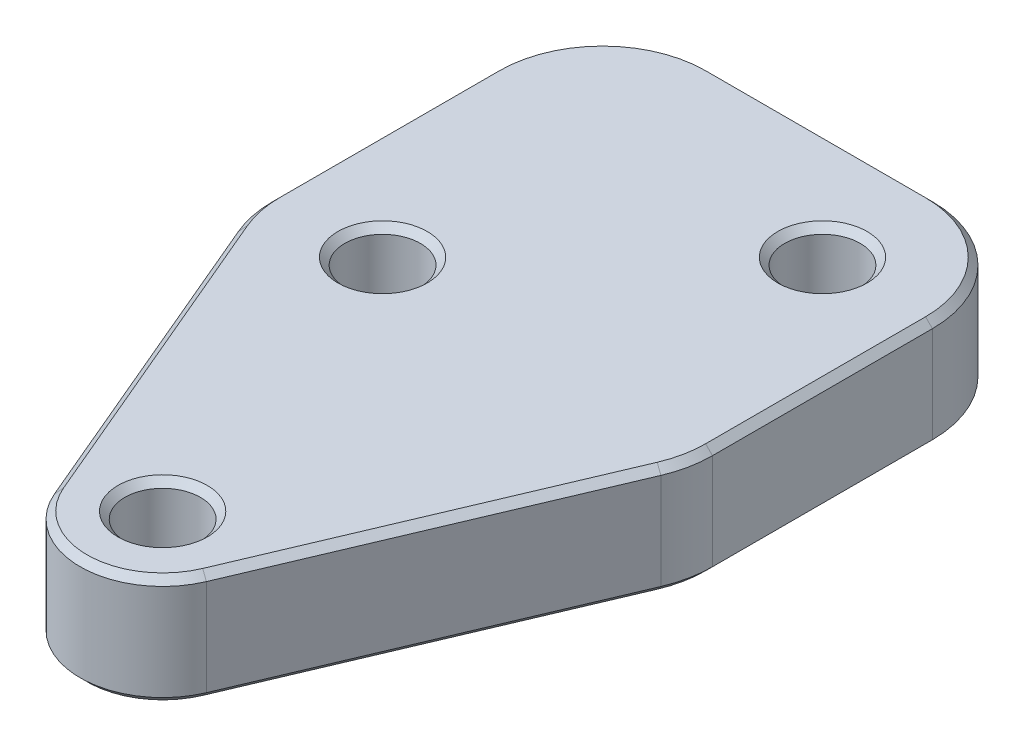
ISO-10303-21;
HEADER;
FILE_DESCRIPTION(('STEP AP214'),'2;1');
FILE_NAME('part.step','',(''),(''),'','','');
FILE_SCHEMA(('AUTOMOTIVE_DESIGN { 1 0 10303 214 1 1 1 1 }'));
ENDSEC;
DATA;
#1=APPLICATION_CONTEXT('core data for automotive mechanical design processes');
#2=APPLICATION_PROTOCOL_DEFINITION('international standard','automotive_design',2000,#1);
#3=PRODUCT_CONTEXT('',#1,'mechanical');
#4=PRODUCT('Part','Part','',(#3));
#5=PRODUCT_RELATED_PRODUCT_CATEGORY('part','',(#4));
#6=PRODUCT_DEFINITION_FORMATION('','',#4);
#7=PRODUCT_DEFINITION_CONTEXT('part definition',#1,'design');
#8=PRODUCT_DEFINITION('design','',#6,#7);
#9=PRODUCT_DEFINITION_SHAPE('','',#8);
#10=(LENGTH_UNIT() NAMED_UNIT(*) SI_UNIT(.MILLI.,.METRE.));
#11=(NAMED_UNIT(*) PLANE_ANGLE_UNIT() SI_UNIT($,.RADIAN.));
#12=(NAMED_UNIT(*) SI_UNIT($,.STERADIAN.) SOLID_ANGLE_UNIT());
#13=UNCERTAINTY_MEASURE_WITH_UNIT(LENGTH_MEASURE(1.E-05),#10,'distance_accuracy_value','');
#14=(GEOMETRIC_REPRESENTATION_CONTEXT(3) GLOBAL_UNCERTAINTY_ASSIGNED_CONTEXT((#13)) GLOBAL_UNIT_ASSIGNED_CONTEXT((#10,
#11,#12)) REPRESENTATION_CONTEXT('',''));
#15=CARTESIAN_POINT('',(0.,0.,0.));
#16=DIRECTION('',(0.,0.,1.));
#17=DIRECTION('',(1.,0.,0.));
#18=AXIS2_PLACEMENT_3D('',#15,#16,#17);
#19=CARTESIAN_POINT('',(6.35,6.35,-19.05));
#20=DIRECTION('',(0.,1.,0.));
#21=DIRECTION('',(0.,0.,1.));
#22=AXIS2_PLACEMENT_3D('',#19,#20,#21);
#23=PLANE('',#22);
#24=CARTESIAN_POINT('',(-6.35,6.35,-19.05));
#25=DIRECTION('',(0.,1.,0.));
#26=DIRECTION('',(0.,0.,1.));
#27=AXIS2_PLACEMENT_3D('',#24,#25,#26);
#28=CIRCLE('',#27,2.57968750000002);
#29=CARTESIAN_POINT('',(-6.35,6.35,-16.4703125));
#30=VERTEX_POINT('',#29);
#31=EDGE_CURVE('E11',#30,#30,#28,.F.);
#32=ORIENTED_EDGE('',*,*,#31,.T.);
#33=EDGE_LOOP('',(#32));
#34=FACE_BOUND('',#33,.T.);
#35=CARTESIAN_POINT('',(0.,6.35,0.));
#36=DIRECTION('',(0.,1.,0.));
#37=DIRECTION('',(0.,0.,1.));
#38=AXIS2_PLACEMENT_3D('',#35,#36,#37);
#39=CIRCLE('',#38,2.57968749999999);
#40=CARTESIAN_POINT('',(0.,6.35,2.57968749999999));
#41=VERTEX_POINT('',#40);
#42=EDGE_CURVE('E53',#41,#41,#39,.F.);
#43=ORIENTED_EDGE('',*,*,#42,.T.);
#44=EDGE_LOOP('',(#43));
#45=FACE_BOUND('',#44,.T.);
#46=CARTESIAN_POINT('',(0.,6.35,0.));
#47=DIRECTION('',(0.,1.,0.));
#48=DIRECTION('',(0.,0.,1.));
#49=AXIS2_PLACEMENT_3D('',#46,#47,#48);
#50=CIRCLE('',#49,4.365625);
#51=CARTESIAN_POINT('',(-4.01949212596417,6.35,1.70363279198806));
#52=VERTEX_POINT('',#51);
#53=CARTESIAN_POINT('',(4.01949212596417,6.35,1.70363279198806));
#54=VERTEX_POINT('',#53);
#55=EDGE_CURVE('E61',#52,#54,#50,.T.);
#56=ORIENTED_EDGE('',*,*,#55,.T.);
#57=DIRECTION('',(0.390238005322962,0.,-0.920714015968887));
#58=VECTOR('',#57,1.);
#59=CARTESIAN_POINT('',(11.8311256263148,6.35,-16.7268643745617));
#60=LINE('',#59,#58);
#61=CARTESIAN_POINT('',(11.8311256263148,6.35,-16.7268643745617));
#62=VERTEX_POINT('',#61);
#63=EDGE_CURVE('E301',#54,#62,#60,.T.);
#64=ORIENTED_EDGE('',*,*,#63,.T.);
#65=CARTESIAN_POINT('',(6.35,6.35,-19.05));
#66=DIRECTION('',(0.,1.,0.));
#67=DIRECTION('',(0.,0.,1.));
#68=AXIS2_PLACEMENT_3D('',#65,#66,#67);
#69=CIRCLE('',#68,5.953125);
#70=CARTESIAN_POINT('',(12.303125,6.35,-19.05));
#71=VERTEX_POINT('',#70);
#72=EDGE_CURVE('E285',#62,#71,#69,.T.);
#73=ORIENTED_EDGE('',*,*,#72,.T.);
#74=DIRECTION('',(0.,0.,-1.));
#75=VECTOR('',#74,1.);
#76=CARTESIAN_POINT('',(12.303125,6.35,-31.75));
#77=LINE('',#76,#75);
#78=CARTESIAN_POINT('',(12.303125,6.35,-31.75));
#79=VERTEX_POINT('',#78);
#80=EDGE_CURVE('E287',#71,#79,#77,.T.);
#81=ORIENTED_EDGE('',*,*,#80,.T.);
#82=CARTESIAN_POINT('',(6.35,6.35,-31.75));
#83=DIRECTION('',(0.,1.,0.));
#84=DIRECTION('',(0.,0.,1.));
#85=AXIS2_PLACEMENT_3D('',#82,#83,#84);
#86=CIRCLE('',#85,5.953125);
#87=CARTESIAN_POINT('',(6.34999999999995,6.35,-37.703125));
#88=VERTEX_POINT('',#87);
#89=EDGE_CURVE('E289',#79,#88,#86,.T.);
#90=ORIENTED_EDGE('',*,*,#89,.T.);
#91=DIRECTION('',(-1.,0.,0.));
#92=VECTOR('',#91,1.);
#93=CARTESIAN_POINT('',(-6.34999999999996,6.35,-37.703125));
#94=LINE('',#93,#92);
#95=CARTESIAN_POINT('',(-6.34999999999996,6.35,-37.703125));
#96=VERTEX_POINT('',#95);
#97=EDGE_CURVE('E291',#88,#96,#94,.T.);
#98=ORIENTED_EDGE('',*,*,#97,.T.);
#99=CARTESIAN_POINT('',(-6.35,6.35,-31.75));
#100=DIRECTION('',(0.,1.,0.));
#101=DIRECTION('',(0.,0.,1.));
#102=AXIS2_PLACEMENT_3D('',#99,#100,#101);
#103=CIRCLE('',#102,5.953125);
#104=CARTESIAN_POINT('',(-12.303125,6.35,-31.75));
#105=VERTEX_POINT('',#104);
#106=EDGE_CURVE('E293',#96,#105,#103,.T.);
#107=ORIENTED_EDGE('',*,*,#106,.T.);
#108=DIRECTION('',(0.,0.,1.));
#109=VECTOR('',#108,1.);
#110=CARTESIAN_POINT('',(-12.303125,6.35,-19.05));
#111=LINE('',#110,#109);
#112=CARTESIAN_POINT('',(-12.303125,6.35,-19.05));
#113=VERTEX_POINT('',#112);
#114=EDGE_CURVE('E295',#105,#113,#111,.T.);
#115=ORIENTED_EDGE('',*,*,#114,.T.);
#116=CARTESIAN_POINT('',(-6.35,6.35,-19.05));
#117=DIRECTION('',(0.,1.,0.));
#118=DIRECTION('',(0.,0.,1.));
#119=AXIS2_PLACEMENT_3D('',#116,#117,#118);
#120=CIRCLE('',#119,5.953125);
#121=CARTESIAN_POINT('',(-11.8311256263148,6.35,-16.7268643745617));
#122=VERTEX_POINT('',#121);
#123=EDGE_CURVE('E297',#113,#122,#120,.T.);
#124=ORIENTED_EDGE('',*,*,#123,.T.);
#125=DIRECTION('',(0.390238005322962,0.,0.920714015968887));
#126=VECTOR('',#125,1.);
#127=CARTESIAN_POINT('',(-4.01949212596417,6.35,1.70363279198806));
#128=LINE('',#127,#126);
#129=EDGE_CURVE('E66',#122,#52,#128,.T.);
#130=ORIENTED_EDGE('',*,*,#129,.T.);
#131=EDGE_LOOP('',(#56,#64,#73,#81,#90,#98,#107,#115,#124,#130));
#132=FACE_BOUND('',#131,.T.);
#133=CARTESIAN_POINT('',(6.35,6.35,-31.75));
#134=DIRECTION('',(0.,1.,0.));
#135=DIRECTION('',(0.,0.,1.));
#136=AXIS2_PLACEMENT_3D('',#133,#134,#135);
#137=CIRCLE('',#136,2.57968749999999);
#138=CARTESIAN_POINT('',(6.35,6.35,-29.1703125));
#139=VERTEX_POINT('',#138);
#140=EDGE_CURVE('E282',#139,#139,#137,.F.);
#141=ORIENTED_EDGE('',*,*,#140,.T.);
#142=EDGE_LOOP('',(#141));
#143=FACE_BOUND('',#142,.T.);
#144=ADVANCED_FACE('F43',(#34,#45,#132,#143),#23,.T.);
#145=CARTESIAN_POINT('',(6.35,0.,-19.05));
#146=DIRECTION('',(0.,1.,0.));
#147=DIRECTION('',(0.,0.,1.));
#148=AXIS2_PLACEMENT_3D('',#145,#146,#147);
#149=PLANE('',#148);
#150=CARTESIAN_POINT('',(-6.35,0.,-19.05));
#151=DIRECTION('',(0.,1.,0.));
#152=DIRECTION('',(0.,0.,1.));
#153=AXIS2_PLACEMENT_3D('',#150,#151,#152);
#154=CIRCLE('',#153,2.57968750000001);
#155=CARTESIAN_POINT('',(-6.35,0.,-16.4703125));
#156=VERTEX_POINT('',#155);
#157=EDGE_CURVE('E221',#156,#156,#154,.T.);
#158=ORIENTED_EDGE('',*,*,#157,.T.);
#159=EDGE_LOOP('',(#158));
#160=FACE_BOUND('',#159,.T.);
#161=CARTESIAN_POINT('',(6.35,0.,-31.75));
#162=DIRECTION('',(0.,1.,0.));
#163=DIRECTION('',(0.,0.,1.));
#164=AXIS2_PLACEMENT_3D('',#161,#162,#163);
#165=CIRCLE('',#164,2.5796875);
#166=CARTESIAN_POINT('',(6.35,0.,-29.1703125));
#167=VERTEX_POINT('',#166);
#168=EDGE_CURVE('E213',#167,#167,#165,.T.);
#169=ORIENTED_EDGE('',*,*,#168,.T.);
#170=EDGE_LOOP('',(#169));
#171=FACE_BOUND('',#170,.T.);
#172=CARTESIAN_POINT('',(0.,0.,0.));
#173=DIRECTION('',(0.,1.,0.));
#174=DIRECTION('',(0.,0.,1.));
#175=AXIS2_PLACEMENT_3D('',#172,#173,#174);
#176=CIRCLE('',#175,2.5796875);
#177=CARTESIAN_POINT('',(0.,0.,2.5796875));
#178=VERTEX_POINT('',#177);
#179=EDGE_CURVE('E210',#178,#178,#176,.T.);
#180=ORIENTED_EDGE('',*,*,#179,.T.);
#181=EDGE_LOOP('',(#180));
#182=FACE_BOUND('',#181,.T.);
#183=CARTESIAN_POINT('',(6.35,0.,-31.75));
#184=DIRECTION('',(0.,1.,0.));
#185=DIRECTION('',(0.,0.,1.));
#186=AXIS2_PLACEMENT_3D('',#183,#184,#185);
#187=CIRCLE('',#186,5.953125);
#188=CARTESIAN_POINT('',(6.34999999999996,0.,-37.703125));
#189=VERTEX_POINT('',#188);
#190=CARTESIAN_POINT('',(12.303125,0.,-31.75));
#191=VERTEX_POINT('',#190);
#192=EDGE_CURVE('E209',#189,#191,#187,.F.);
#193=ORIENTED_EDGE('',*,*,#192,.T.);
#194=DIRECTION('',(0.,0.,1.));
#195=VECTOR('',#194,1.);
#196=CARTESIAN_POINT('',(12.303125,0.,-19.05));
#197=LINE('',#196,#195);
#198=CARTESIAN_POINT('',(12.303125,0.,-19.05));
#199=VERTEX_POINT('',#198);
#200=EDGE_CURVE('E188',#191,#199,#197,.T.);
#201=ORIENTED_EDGE('',*,*,#200,.T.);
#202=CARTESIAN_POINT('',(6.35,0.,-19.05));
#203=DIRECTION('',(0.,1.,0.));
#204=DIRECTION('',(0.,0.,1.));
#205=AXIS2_PLACEMENT_3D('',#202,#203,#204);
#206=CIRCLE('',#205,5.953125);
#207=CARTESIAN_POINT('',(11.8311256263148,0.,-16.7268643745617));
#208=VERTEX_POINT('',#207);
#209=EDGE_CURVE('E198',#199,#208,#206,.F.);
#210=ORIENTED_EDGE('',*,*,#209,.T.);
#211=DIRECTION('',(-0.390238005322962,0.,0.920714015968887));
#212=VECTOR('',#211,1.);
#213=CARTESIAN_POINT('',(11.8311256263148,0.,-16.7268643745617));
#214=LINE('',#213,#212);
#215=CARTESIAN_POINT('',(4.01949212596417,0.,1.70363279198806));
#216=VERTEX_POINT('',#215);
#217=EDGE_CURVE('E204',#208,#216,#214,.T.);
#218=ORIENTED_EDGE('',*,*,#217,.T.);
#219=CARTESIAN_POINT('',(0.,0.,0.));
#220=DIRECTION('',(0.,1.,0.));
#221=DIRECTION('',(0.,0.,1.));
#222=AXIS2_PLACEMENT_3D('',#219,#220,#221);
#223=CIRCLE('',#222,4.365625);
#224=CARTESIAN_POINT('',(-4.01949212596417,0.,1.70363279198806));
#225=VERTEX_POINT('',#224);
#226=EDGE_CURVE('E393',#216,#225,#223,.F.);
#227=ORIENTED_EDGE('',*,*,#226,.T.);
#228=DIRECTION('',(-0.390238005322962,0.,-0.920714015968887));
#229=VECTOR('',#228,1.);
#230=CARTESIAN_POINT('',(-9.89709722617454,0.,-12.1637848410414));
#231=LINE('',#230,#229);
#232=CARTESIAN_POINT('',(-11.8311256263148,0.,-16.7268643745617));
#233=VERTEX_POINT('',#232);
#234=EDGE_CURVE('E395',#225,#233,#231,.T.);
#235=ORIENTED_EDGE('',*,*,#234,.T.);
#236=CARTESIAN_POINT('',(-6.35,0.,-19.05));
#237=DIRECTION('',(0.,1.,0.));
#238=DIRECTION('',(0.,0.,1.));
#239=AXIS2_PLACEMENT_3D('',#236,#237,#238);
#240=CIRCLE('',#239,5.953125);
#241=CARTESIAN_POINT('',(-12.303125,0.,-19.05));
#242=VERTEX_POINT('',#241);
#243=EDGE_CURVE('E397',#233,#242,#240,.F.);
#244=ORIENTED_EDGE('',*,*,#243,.T.);
#245=DIRECTION('',(0.,0.,-1.));
#246=VECTOR('',#245,1.);
#247=CARTESIAN_POINT('',(-12.303125,0.,-19.05));
#248=LINE('',#247,#246);
#249=CARTESIAN_POINT('',(-12.303125,0.,-31.75));
#250=VERTEX_POINT('',#249);
#251=EDGE_CURVE('E399',#242,#250,#248,.T.);
#252=ORIENTED_EDGE('',*,*,#251,.T.);
#253=CARTESIAN_POINT('',(-6.35,0.,-31.75));
#254=DIRECTION('',(0.,1.,0.));
#255=DIRECTION('',(0.,0.,1.));
#256=AXIS2_PLACEMENT_3D('',#253,#254,#255);
#257=CIRCLE('',#256,5.953125);
#258=CARTESIAN_POINT('',(-6.34999999999996,0.,-37.703125));
#259=VERTEX_POINT('',#258);
#260=EDGE_CURVE('E401',#250,#259,#257,.F.);
#261=ORIENTED_EDGE('',*,*,#260,.T.);
#262=DIRECTION('',(1.,0.,0.));
#263=VECTOR('',#262,1.);
#264=CARTESIAN_POINT('',(6.35,0.,-37.703125));
#265=LINE('',#264,#263);
#266=EDGE_CURVE('E215',#259,#189,#265,.T.);
#267=ORIENTED_EDGE('',*,*,#266,.T.);
#268=EDGE_LOOP('',(#193,#201,#210,#218,#227,#235,#244,#252,#261,#267));
#269=FACE_BOUND('',#268,.T.);
#270=ADVANCED_FACE('F207',(#160,#171,#182,#269),#149,.F.);
#271=CARTESIAN_POINT('',(6.35,6.35,-19.05));
#272=DIRECTION('',(0.,-1.,0.));
#273=DIRECTION('',(0.,0.,-1.));
#274=AXIS2_PLACEMENT_3D('',#271,#272,#273);
#275=CYLINDRICAL_SURFACE('',#274,6.35);
#276=DIRECTION('',(0.,-1.,0.));
#277=VECTOR('',#276,1.);
#278=CARTESIAN_POINT('',(12.1965340014024,6.35,-16.5719886661992));
#279=LINE('',#278,#277);
#280=CARTESIAN_POINT('',(12.1965340014024,5.953125,-16.5719886661992));
#281=VERTEX_POINT('',#280);
#282=CARTESIAN_POINT('',(12.1965340014024,0.396875000000001,-16.5719886661992));
#283=VERTEX_POINT('',#282);
#284=EDGE_CURVE('E327',#281,#283,#279,.T.);
#285=ORIENTED_EDGE('',*,*,#284,.T.);
#286=CARTESIAN_POINT('',(6.35,0.396875000000001,-19.05));
#287=DIRECTION('',(0.,1.,0.));
#288=DIRECTION('',(0.,0.,1.));
#289=AXIS2_PLACEMENT_3D('',#286,#287,#288);
#290=CIRCLE('',#289,6.35);
#291=CARTESIAN_POINT('',(12.7,0.396875000000001,-19.05));
#292=VERTEX_POINT('',#291);
#293=EDGE_CURVE('E280',#283,#292,#290,.T.);
#294=ORIENTED_EDGE('',*,*,#293,.T.);
#295=DIRECTION('',(0.,-1.,0.));
#296=VECTOR('',#295,1.);
#297=CARTESIAN_POINT('',(12.7,6.35,-19.05));
#298=LINE('',#297,#296);
#299=CARTESIAN_POINT('',(12.7,5.953125,-19.05));
#300=VERTEX_POINT('',#299);
#301=EDGE_CURVE('E205',#300,#292,#298,.T.);
#302=ORIENTED_EDGE('',*,*,#301,.F.);
#303=CARTESIAN_POINT('',(6.35,5.953125,-19.05));
#304=DIRECTION('',(0.,1.,0.));
#305=DIRECTION('',(0.,0.,1.));
#306=AXIS2_PLACEMENT_3D('',#303,#304,#305);
#307=CIRCLE('',#306,6.35);
#308=EDGE_CURVE('E278',#300,#281,#307,.F.);
#309=ORIENTED_EDGE('',*,*,#308,.T.);
#310=EDGE_LOOP('',(#285,#294,#302,#309));
#311=FACE_BOUND('',#310,.T.);
#312=ADVANCED_FACE('F431',(#311),#275,.T.);
#313=CARTESIAN_POINT('',(12.7,6.35,-19.05));
#314=DIRECTION('',(-1.,0.,0.));
#315=DIRECTION('',(0.,0.,1.));
#316=AXIS2_PLACEMENT_3D('',#313,#314,#315);
#317=PLANE('',#316);
#318=ORIENTED_EDGE('',*,*,#301,.T.);
#319=DIRECTION('',(0.,0.,-1.));
#320=VECTOR('',#319,1.);
#321=CARTESIAN_POINT('',(12.7,0.396875000000001,-19.05));
#322=LINE('',#321,#320);
#323=CARTESIAN_POINT('',(12.7,0.396875000000001,-31.75));
#324=VERTEX_POINT('',#323);
#325=EDGE_CURVE('E191',#292,#324,#322,.T.);
#326=ORIENTED_EDGE('',*,*,#325,.T.);
#327=DIRECTION('',(0.,-1.,0.));
#328=VECTOR('',#327,1.);
#329=CARTESIAN_POINT('',(12.7,6.35,-31.75));
#330=LINE('',#329,#328);
#331=CARTESIAN_POINT('',(12.7,5.953125,-31.75));
#332=VERTEX_POINT('',#331);
#333=EDGE_CURVE('E382',#332,#324,#330,.T.);
#334=ORIENTED_EDGE('',*,*,#333,.F.);
#335=DIRECTION('',(0.,0.,1.));
#336=VECTOR('',#335,1.);
#337=CARTESIAN_POINT('',(12.7,5.953125,-19.05));
#338=LINE('',#337,#336);
#339=EDGE_CURVE('E242',#332,#300,#338,.T.);
#340=ORIENTED_EDGE('',*,*,#339,.T.);
#341=EDGE_LOOP('',(#318,#326,#334,#340));
#342=FACE_BOUND('',#341,.T.);
#343=ADVANCED_FACE('F414',(#342),#317,.F.);
#344=CARTESIAN_POINT('',(6.35,6.35,-31.75));
#345=DIRECTION('',(0.,-1.,0.));
#346=DIRECTION('',(0.,0.,-1.));
#347=AXIS2_PLACEMENT_3D('',#344,#345,#346);
#348=CYLINDRICAL_SURFACE('',#347,6.35);
#349=ORIENTED_EDGE('',*,*,#333,.T.);
#350=CARTESIAN_POINT('',(6.35,0.396875000000001,-31.75));
#351=DIRECTION('',(0.,1.,0.));
#352=DIRECTION('',(0.,0.,1.));
#353=AXIS2_PLACEMENT_3D('',#350,#351,#352);
#354=CIRCLE('',#353,6.35);
#355=CARTESIAN_POINT('',(6.34999999999995,0.396875000000001,-38.1));
#356=VERTEX_POINT('',#355);
#357=EDGE_CURVE('E247',#324,#356,#354,.T.);
#358=ORIENTED_EDGE('',*,*,#357,.T.);
#359=DIRECTION('',(0.,-1.,0.));
#360=VECTOR('',#359,1.);
#361=CARTESIAN_POINT('',(6.34999999999995,6.35,-38.1));
#362=LINE('',#361,#360);
#363=CARTESIAN_POINT('',(6.34999999999995,5.953125,-38.1));
#364=VERTEX_POINT('',#363);
#365=EDGE_CURVE('E380',#364,#356,#362,.T.);
#366=ORIENTED_EDGE('',*,*,#365,.F.);
#367=CARTESIAN_POINT('',(6.35,5.953125,-31.75));
#368=DIRECTION('',(0.,1.,0.));
#369=DIRECTION('',(0.,0.,1.));
#370=AXIS2_PLACEMENT_3D('',#367,#368,#369);
#371=CIRCLE('',#370,6.35);
#372=EDGE_CURVE('E245',#364,#332,#371,.F.);
#373=ORIENTED_EDGE('',*,*,#372,.T.);
#374=EDGE_LOOP('',(#349,#358,#366,#373));
#375=FACE_BOUND('',#374,.T.);
#376=ADVANCED_FACE('F417',(#375),#348,.T.);
#377=CARTESIAN_POINT('',(-6.34999999999996,6.35,-38.1));
#378=DIRECTION('',(0.,0.,1.));
#379=DIRECTION('',(1.,0.,0.));
#380=AXIS2_PLACEMENT_3D('',#377,#378,#379);
#381=PLANE('',#380);
#382=ORIENTED_EDGE('',*,*,#365,.T.);
#383=DIRECTION('',(-1.,0.,0.));
#384=VECTOR('',#383,1.);
#385=CARTESIAN_POINT('',(-6.34999999999996,0.396875000000001,-38.1));
#386=LINE('',#385,#384);
#387=CARTESIAN_POINT('',(-6.34999999999996,0.396875000000001,-38.1));
#388=VERTEX_POINT('',#387);
#389=EDGE_CURVE('E251',#356,#388,#386,.T.);
#390=ORIENTED_EDGE('',*,*,#389,.T.);
#391=DIRECTION('',(0.,-1.,0.));
#392=VECTOR('',#391,1.);
#393=CARTESIAN_POINT('',(-6.34999999999996,6.35,-38.1));
#394=LINE('',#393,#392);
#395=CARTESIAN_POINT('',(-6.34999999999996,5.953125,-38.1));
#396=VERTEX_POINT('',#395);
#397=EDGE_CURVE('E371',#396,#388,#394,.T.);
#398=ORIENTED_EDGE('',*,*,#397,.F.);
#399=DIRECTION('',(1.,0.,0.));
#400=VECTOR('',#399,1.);
#401=CARTESIAN_POINT('',(6.34999999999995,5.953125,-38.1));
#402=LINE('',#401,#400);
#403=EDGE_CURVE('E249',#396,#364,#402,.T.);
#404=ORIENTED_EDGE('',*,*,#403,.T.);
#405=EDGE_LOOP('',(#382,#390,#398,#404));
#406=FACE_BOUND('',#405,.T.);
#407=ADVANCED_FACE('F377',(#406),#381,.F.);
#408=CARTESIAN_POINT('',(-6.35,6.35,-31.75));
#409=DIRECTION('',(0.,-1.,0.));
#410=DIRECTION('',(0.,0.,-1.));
#411=AXIS2_PLACEMENT_3D('',#408,#409,#410);
#412=CYLINDRICAL_SURFACE('',#411,6.35);
#413=ORIENTED_EDGE('',*,*,#397,.T.);
#414=CARTESIAN_POINT('',(-6.35,0.396875000000001,-31.75));
#415=DIRECTION('',(0.,1.,0.));
#416=DIRECTION('',(0.,0.,1.));
#417=AXIS2_PLACEMENT_3D('',#414,#415,#416);
#418=CIRCLE('',#417,6.35);
#419=CARTESIAN_POINT('',(-12.7,0.396875000000001,-31.75));
#420=VERTEX_POINT('',#419);
#421=EDGE_CURVE('E255',#388,#420,#418,.T.);
#422=ORIENTED_EDGE('',*,*,#421,.T.);
#423=DIRECTION('',(0.,-1.,0.));
#424=VECTOR('',#423,1.);
#425=CARTESIAN_POINT('',(-12.7,6.35,-31.75));
#426=LINE('',#425,#424);
#427=CARTESIAN_POINT('',(-12.7,5.953125,-31.75));
#428=VERTEX_POINT('',#427);
#429=EDGE_CURVE('E374',#428,#420,#426,.T.);
#430=ORIENTED_EDGE('',*,*,#429,.F.);
#431=CARTESIAN_POINT('',(-6.35,5.953125,-31.75));
#432=DIRECTION('',(0.,1.,0.));
#433=DIRECTION('',(0.,0.,1.));
#434=AXIS2_PLACEMENT_3D('',#431,#432,#433);
#435=CIRCLE('',#434,6.35);
#436=EDGE_CURVE('E253',#428,#396,#435,.F.);
#437=ORIENTED_EDGE('',*,*,#436,.T.);
#438=EDGE_LOOP('',(#413,#422,#430,#437));
#439=FACE_BOUND('',#438,.T.);
#440=ADVANCED_FACE('F370',(#439),#412,.T.);
#441=CARTESIAN_POINT('',(-12.7,6.35,-19.05));
#442=DIRECTION('',(1.,0.,0.));
#443=DIRECTION('',(0.,0.,-1.));
#444=AXIS2_PLACEMENT_3D('',#441,#442,#443);
#445=PLANE('',#444);
#446=ORIENTED_EDGE('',*,*,#429,.T.);
#447=DIRECTION('',(0.,0.,1.));
#448=VECTOR('',#447,1.);
#449=CARTESIAN_POINT('',(-12.7,0.396875000000001,-19.05));
#450=LINE('',#449,#448);
#451=CARTESIAN_POINT('',(-12.7,0.396875000000001,-19.05));
#452=VERTEX_POINT('',#451);
#453=EDGE_CURVE('E259',#420,#452,#450,.T.);
#454=ORIENTED_EDGE('',*,*,#453,.T.);
#455=DIRECTION('',(0.,-1.,0.));
#456=VECTOR('',#455,1.);
#457=CARTESIAN_POINT('',(-12.7,6.35,-19.05));
#458=LINE('',#457,#456);
#459=CARTESIAN_POINT('',(-12.7,5.953125,-19.05));
#460=VERTEX_POINT('',#459);
#461=EDGE_CURVE('E384',#460,#452,#458,.T.);
#462=ORIENTED_EDGE('',*,*,#461,.F.);
#463=DIRECTION('',(0.,0.,-1.));
#464=VECTOR('',#463,1.);
#465=CARTESIAN_POINT('',(-12.7,5.953125,-31.75));
#466=LINE('',#465,#464);
#467=EDGE_CURVE('E257',#460,#428,#466,.T.);
#468=ORIENTED_EDGE('',*,*,#467,.T.);
#469=EDGE_LOOP('',(#446,#454,#462,#468));
#470=FACE_BOUND('',#469,.T.);
#471=ADVANCED_FACE('F464',(#470),#445,.F.);
#472=CARTESIAN_POINT('',(-6.35,6.35,-19.05));
#473=DIRECTION('',(0.,-1.,0.));
#474=DIRECTION('',(0.,0.,-1.));
#475=AXIS2_PLACEMENT_3D('',#472,#473,#474);
#476=CYLINDRICAL_SURFACE('',#475,6.35);
#477=ORIENTED_EDGE('',*,*,#461,.T.);
#478=CARTESIAN_POINT('',(-6.35,0.396875000000001,-19.05));
#479=DIRECTION('',(0.,1.,0.));
#480=DIRECTION('',(0.,0.,1.));
#481=AXIS2_PLACEMENT_3D('',#478,#479,#480);
#482=CIRCLE('',#481,6.35);
#483=CARTESIAN_POINT('',(-12.1965340014024,0.396875000000001,-16.5719886661992));
#484=VERTEX_POINT('',#483);
#485=EDGE_CURVE('E263',#452,#484,#482,.T.);
#486=ORIENTED_EDGE('',*,*,#485,.T.);
#487=DIRECTION('',(0.,-1.,0.));
#488=VECTOR('',#487,1.);
#489=CARTESIAN_POINT('',(-12.1965340014024,6.35,-16.5719886661992));
#490=LINE('',#489,#488);
#491=CARTESIAN_POINT('',(-12.1965340014024,5.953125,-16.5719886661992));
#492=VERTEX_POINT('',#491);
#493=EDGE_CURVE('E468',#492,#484,#490,.T.);
#494=ORIENTED_EDGE('',*,*,#493,.F.);
#495=CARTESIAN_POINT('',(-6.35,5.953125,-19.05));
#496=DIRECTION('',(0.,1.,0.));
#497=DIRECTION('',(0.,0.,1.));
#498=AXIS2_PLACEMENT_3D('',#495,#496,#497);
#499=CIRCLE('',#498,6.35);
#500=EDGE_CURVE('E261',#492,#460,#499,.F.);
#501=ORIENTED_EDGE('',*,*,#500,.T.);
#502=EDGE_LOOP('',(#477,#486,#494,#501));
#503=FACE_BOUND('',#502,.T.);
#504=ADVANCED_FACE('F527',(#503),#476,.T.);
#505=CARTESIAN_POINT('',(-12.1965340014024,6.35,-16.5719886661992));
#506=DIRECTION('',(0.920714015968887,0.,-0.390238005322962));
#507=DIRECTION('',(-0.390238005322962,0.,-0.920714015968887));
#508=AXIS2_PLACEMENT_3D('',#505,#506,#507);
#509=PLANE('',#508);
#510=ORIENTED_EDGE('',*,*,#493,.T.);
#511=DIRECTION('',(0.390238005322962,0.,0.920714015968887));
#512=VECTOR('',#511,1.);
#513=CARTESIAN_POINT('',(-12.1965340014024,0.396875000000001,-16.5719886661992));
#514=LINE('',#513,#512);
#515=CARTESIAN_POINT('',(-4.38490050105182,0.396875000000001,1.85850850035061));
#516=VERTEX_POINT('',#515);
#517=EDGE_CURVE('E267',#484,#516,#514,.T.);
#518=ORIENTED_EDGE('',*,*,#517,.T.);
#519=DIRECTION('',(0.,-1.,0.));
#520=VECTOR('',#519,1.);
#521=CARTESIAN_POINT('',(-4.38490050105182,6.35,1.85850850035061));
#522=LINE('',#521,#520);
#523=CARTESIAN_POINT('',(-4.38490050105182,5.953125,1.85850850035061));
#524=VERTEX_POINT('',#523);
#525=EDGE_CURVE('E470',#524,#516,#522,.T.);
#526=ORIENTED_EDGE('',*,*,#525,.F.);
#527=DIRECTION('',(-0.390238005322962,0.,-0.920714015968887));
#528=VECTOR('',#527,1.);
#529=CARTESIAN_POINT('',(-12.1965340014024,5.953125,-16.5719886661992));
#530=LINE('',#529,#528);
#531=EDGE_CURVE('E265',#524,#492,#530,.T.);
#532=ORIENTED_EDGE('',*,*,#531,.T.);
#533=EDGE_LOOP('',(#510,#518,#526,#532));
#534=FACE_BOUND('',#533,.T.);
#535=ADVANCED_FACE('F484',(#534),#509,.F.);
#536=CARTESIAN_POINT('',(0.,6.35,0.));
#537=DIRECTION('',(0.,-1.,0.));
#538=DIRECTION('',(0.,0.,-1.));
#539=AXIS2_PLACEMENT_3D('',#536,#537,#538);
#540=CYLINDRICAL_SURFACE('',#539,4.7625);
#541=ORIENTED_EDGE('',*,*,#525,.T.);
#542=CARTESIAN_POINT('',(0.,0.396875000000001,0.));
#543=DIRECTION('',(0.,1.,0.));
#544=DIRECTION('',(0.,0.,1.));
#545=AXIS2_PLACEMENT_3D('',#542,#543,#544);
#546=CIRCLE('',#545,4.7625);
#547=CARTESIAN_POINT('',(4.38490050105182,0.396874999999999,1.85850850035061));
#548=VERTEX_POINT('',#547);
#549=EDGE_CURVE('E271',#516,#548,#546,.T.);
#550=ORIENTED_EDGE('',*,*,#549,.T.);
#551=DIRECTION('',(0.,-1.,0.));
#552=VECTOR('',#551,1.);
#553=CARTESIAN_POINT('',(4.38490050105182,6.35,1.85850850035061));
#554=LINE('',#553,#552);
#555=CARTESIAN_POINT('',(4.38490050105182,5.953125,1.85850850035061));
#556=VERTEX_POINT('',#555);
#557=EDGE_CURVE('E435',#556,#548,#554,.T.);
#558=ORIENTED_EDGE('',*,*,#557,.F.);
#559=CARTESIAN_POINT('',(0.,5.953125,0.));
#560=DIRECTION('',(0.,1.,0.));
#561=DIRECTION('',(0.,0.,1.));
#562=AXIS2_PLACEMENT_3D('',#559,#560,#561);
#563=CIRCLE('',#562,4.7625);
#564=EDGE_CURVE('E269',#556,#524,#563,.F.);
#565=ORIENTED_EDGE('',*,*,#564,.T.);
#566=EDGE_LOOP('',(#541,#550,#558,#565));
#567=FACE_BOUND('',#566,.T.);
#568=ADVANCED_FACE('F479',(#567),#540,.T.);
#569=CARTESIAN_POINT('',(4.38490050105182,6.35,1.85850850035061));
#570=DIRECTION('',(-0.920714015968887,0.,-0.390238005322962));
#571=DIRECTION('',(-0.390238005322962,0.,0.920714015968887));
#572=AXIS2_PLACEMENT_3D('',#569,#570,#571);
#573=PLANE('',#572);
#574=ORIENTED_EDGE('',*,*,#557,.T.);
#575=DIRECTION('',(0.390238005322962,0.,-0.920714015968887));
#576=VECTOR('',#575,1.);
#577=CARTESIAN_POINT('',(4.38490050105182,0.396874999999999,1.85850850035061));
#578=LINE('',#577,#576);
#579=EDGE_CURVE('E276',#548,#283,#578,.T.);
#580=ORIENTED_EDGE('',*,*,#579,.T.);
#581=ORIENTED_EDGE('',*,*,#284,.F.);
#582=DIRECTION('',(-0.390238005322962,0.,0.920714015968887));
#583=VECTOR('',#582,1.);
#584=CARTESIAN_POINT('',(4.38490050105182,5.953125,1.85850850035061));
#585=LINE('',#584,#583);
#586=EDGE_CURVE('E273',#281,#556,#585,.T.);
#587=ORIENTED_EDGE('',*,*,#586,.T.);
#588=EDGE_LOOP('',(#574,#580,#581,#587));
#589=FACE_BOUND('',#588,.T.);
#590=ADVANCED_FACE('F477',(#589),#573,.F.);
#591=CARTESIAN_POINT('',(0.,6.35,0.));
#592=DIRECTION('',(0.,-1.,0.));
#593=DIRECTION('',(0.,0.,-1.));
#594=AXIS2_PLACEMENT_3D('',#591,#592,#593);
#595=CYLINDRICAL_SURFACE('',#594,2.1828125);
#596=CARTESIAN_POINT('',(0.,0.396875000000004,0.));
#597=DIRECTION('',(0.,1.,0.));
#598=DIRECTION('',(0.,0.,1.));
#599=AXIS2_PLACEMENT_3D('',#596,#597,#598);
#600=CIRCLE('',#599,2.1828125);
#601=CARTESIAN_POINT('',(0.,0.396875000000004,2.1828125));
#602=VERTEX_POINT('',#601);
#603=EDGE_CURVE('E239',#602,#602,#600,.F.);
#604=ORIENTED_EDGE('',*,*,#603,.T.);
#605=EDGE_LOOP('',(#604));
#606=FACE_BOUND('',#605,.T.);
#607=CARTESIAN_POINT('',(0.,5.95312500000001,0.));
#608=DIRECTION('',(0.,1.,0.));
#609=DIRECTION('',(0.,0.,1.));
#610=AXIS2_PLACEMENT_3D('',#607,#608,#609);
#611=CIRCLE('',#610,2.1828125);
#612=CARTESIAN_POINT('',(0.,5.95312500000001,2.1828125));
#613=VERTEX_POINT('',#612);
#614=EDGE_CURVE('E236',#613,#613,#611,.T.);
#615=ORIENTED_EDGE('',*,*,#614,.T.);
#616=EDGE_LOOP('',(#615));
#617=FACE_BOUND('',#616,.T.);
#618=ADVANCED_FACE('F518',(#606,#617),#595,.F.);
#619=CARTESIAN_POINT('',(6.35,6.35,-31.75));
#620=DIRECTION('',(0.,-1.,0.));
#621=DIRECTION('',(0.,0.,-1.));
#622=AXIS2_PLACEMENT_3D('',#619,#620,#621);
#623=CYLINDRICAL_SURFACE('',#622,2.1828125);
#624=CARTESIAN_POINT('',(6.35,0.396874999999998,-31.75));
#625=DIRECTION('',(0.,1.,0.));
#626=DIRECTION('',(0.,0.,1.));
#627=AXIS2_PLACEMENT_3D('',#624,#625,#626);
#628=CIRCLE('',#627,2.1828125);
#629=CARTESIAN_POINT('',(6.35,0.396874999999998,-29.5671875));
#630=VERTEX_POINT('',#629);
#631=EDGE_CURVE('E233',#630,#630,#628,.F.);
#632=ORIENTED_EDGE('',*,*,#631,.T.);
#633=EDGE_LOOP('',(#632));
#634=FACE_BOUND('',#633,.T.);
#635=CARTESIAN_POINT('',(6.35,5.95312500000001,-31.75));
#636=DIRECTION('',(0.,1.,0.));
#637=DIRECTION('',(0.,0.,1.));
#638=AXIS2_PLACEMENT_3D('',#635,#636,#637);
#639=CIRCLE('',#638,2.1828125);
#640=CARTESIAN_POINT('',(6.35,5.95312500000001,-29.5671875));
#641=VERTEX_POINT('',#640);
#642=EDGE_CURVE('E230',#641,#641,#639,.T.);
#643=ORIENTED_EDGE('',*,*,#642,.T.);
#644=EDGE_LOOP('',(#643));
#645=FACE_BOUND('',#644,.T.);
#646=ADVANCED_FACE('F720',(#634,#645),#623,.F.);
#647=CARTESIAN_POINT('',(-6.35,6.35,-19.05));
#648=DIRECTION('',(0.,-1.,0.));
#649=DIRECTION('',(0.,0.,-1.));
#650=AXIS2_PLACEMENT_3D('',#647,#648,#649);
#651=CYLINDRICAL_SURFACE('',#650,2.1828125);
#652=CARTESIAN_POINT('',(-6.35,0.396875000000003,-19.05));
#653=DIRECTION('',(0.,1.,0.));
#654=DIRECTION('',(0.,0.,1.));
#655=AXIS2_PLACEMENT_3D('',#652,#653,#654);
#656=CIRCLE('',#655,2.1828125);
#657=CARTESIAN_POINT('',(-6.35,0.396875000000003,-16.8671875));
#658=VERTEX_POINT('',#657);
#659=EDGE_CURVE('E227',#658,#658,#656,.F.);
#660=ORIENTED_EDGE('',*,*,#659,.T.);
#661=EDGE_LOOP('',(#660));
#662=FACE_BOUND('',#661,.T.);
#663=CARTESIAN_POINT('',(-6.35,5.95312499999998,-19.05));
#664=DIRECTION('',(0.,1.,0.));
#665=DIRECTION('',(0.,0.,1.));
#666=AXIS2_PLACEMENT_3D('',#663,#664,#665);
#667=CIRCLE('',#666,2.1828125);
#668=CARTESIAN_POINT('',(-6.35,5.95312499999998,-16.8671875));
#669=VERTEX_POINT('',#668);
#670=EDGE_CURVE('E224',#669,#669,#667,.T.);
#671=ORIENTED_EDGE('',*,*,#670,.T.);
#672=EDGE_LOOP('',(#671));
#673=FACE_BOUND('',#672,.T.);
#674=ADVANCED_FACE('F550',(#662,#673),#651,.F.);
#675=CARTESIAN_POINT('',(-6.35,0.,-19.05));
#676=DIRECTION('',(0.,-1.,0.));
#677=DIRECTION('',(0.,0.,-1.));
#678=AXIS2_PLACEMENT_3D('',#675,#676,#677);
#679=CONICAL_SURFACE('',#678,2.57968750000001,0.785398163397453);
#680=ORIENTED_EDGE('',*,*,#659,.F.);
#681=EDGE_LOOP('',(#680));
#682=FACE_BOUND('',#681,.T.);
#683=ORIENTED_EDGE('',*,*,#157,.F.);
#684=EDGE_LOOP('',(#683));
#685=FACE_BOUND('',#684,.T.);
#686=ADVANCED_FACE('F543',(#682,#685),#679,.F.);
#687=CARTESIAN_POINT('',(6.35,0.,-31.75));
#688=DIRECTION('',(0.,-1.,0.));
#689=DIRECTION('',(0.,0.,-1.));
#690=AXIS2_PLACEMENT_3D('',#687,#688,#689);
#691=CONICAL_SURFACE('',#690,2.5796875,0.785398163397447);
#692=ORIENTED_EDGE('',*,*,#631,.F.);
#693=EDGE_LOOP('',(#692));
#694=FACE_BOUND('',#693,.T.);
#695=ORIENTED_EDGE('',*,*,#168,.F.);
#696=EDGE_LOOP('',(#695));
#697=FACE_BOUND('',#696,.T.);
#698=ADVANCED_FACE('F549',(#694,#697),#691,.F.);
#699=CARTESIAN_POINT('',(0.,0.,0.));
#700=DIRECTION('',(0.,-1.,0.));
#701=DIRECTION('',(0.,0.,-1.));
#702=AXIS2_PLACEMENT_3D('',#699,#700,#701);
#703=CONICAL_SURFACE('',#702,2.5796875,0.785398163397448);
#704=ORIENTED_EDGE('',*,*,#603,.F.);
#705=EDGE_LOOP('',(#704));
#706=FACE_BOUND('',#705,.T.);
#707=ORIENTED_EDGE('',*,*,#179,.F.);
#708=EDGE_LOOP('',(#707));
#709=FACE_BOUND('',#708,.T.);
#710=ADVANCED_FACE('F557',(#706,#709),#703,.F.);
#711=CARTESIAN_POINT('',(-6.35,0.396875000000001,-19.05));
#712=DIRECTION('',(0.,1.,0.));
#713=DIRECTION('',(0.,0.,1.));
#714=AXIS2_PLACEMENT_3D('',#711,#712,#713);
#715=CONICAL_SURFACE('',#714,6.35,0.785398163397449);
#716=DIRECTION('',(-0.707106781186548,0.707106781186547,0.));
#717=VECTOR('',#716,1.);
#718=CARTESIAN_POINT('',(-12.303125,0.,-19.05));
#719=LINE('',#718,#717);
#720=EDGE_CURVE('E321',#242,#452,#719,.T.);
#721=ORIENTED_EDGE('',*,*,#720,.F.);
#722=ORIENTED_EDGE('',*,*,#243,.F.);
#723=DIRECTION('',(0.6510431242251,-0.707106781186547,-0.275939939840579));
#724=VECTOR('',#723,1.);
#725=CARTESIAN_POINT('',(-12.1965340014024,0.396875000000001,-16.5719886661992));
#726=LINE('',#725,#724);
#727=EDGE_CURVE('E324',#484,#233,#726,.T.);
#728=ORIENTED_EDGE('',*,*,#727,.F.);
#729=ORIENTED_EDGE('',*,*,#485,.F.);
#730=EDGE_LOOP('',(#721,#722,#728,#729));
#731=FACE_BOUND('',#730,.T.);
#732=ADVANCED_FACE('F454',(#731),#715,.T.);
#733=CARTESIAN_POINT('',(-12.1965340014024,0.396875000000001,-16.5719886661992));
#734=DIRECTION('',(0.651043124225102,0.707106781186545,-0.27593993984058));
#735=DIRECTION('',(0.390238005322962,0.,0.920714015968887));
#736=AXIS2_PLACEMENT_3D('',#733,#734,#735);
#737=PLANE('',#736);
#738=ORIENTED_EDGE('',*,*,#727,.T.);
#739=ORIENTED_EDGE('',*,*,#234,.F.);
#740=DIRECTION('',(0.651043124225097,-0.70710678118655,-0.275939939840577));
#741=VECTOR('',#740,1.);
#742=CARTESIAN_POINT('',(-4.38490050105182,0.396875000000001,1.85850850035061));
#743=LINE('',#742,#741);
#744=EDGE_CURVE('E318',#516,#225,#743,.T.);
#745=ORIENTED_EDGE('',*,*,#744,.F.);
#746=ORIENTED_EDGE('',*,*,#517,.F.);
#747=EDGE_LOOP('',(#738,#739,#745,#746));
#748=FACE_BOUND('',#747,.T.);
#749=ADVANCED_FACE('F449',(#748),#737,.F.);
#750=CARTESIAN_POINT('',(-12.7,0.396875000000001,-19.05));
#751=DIRECTION('',(0.707106781186547,0.707106781186548,0.));
#752=DIRECTION('',(0.,0.,1.));
#753=AXIS2_PLACEMENT_3D('',#750,#751,#752);
#754=PLANE('',#753);
#755=ORIENTED_EDGE('',*,*,#720,.T.);
#756=ORIENTED_EDGE('',*,*,#453,.F.);
#757=DIRECTION('',(-0.707106781186548,0.707106781186547,0.));
#758=VECTOR('',#757,1.);
#759=CARTESIAN_POINT('',(-12.303125,0.,-31.75));
#760=LINE('',#759,#758);
#761=EDGE_CURVE('E315',#250,#420,#760,.T.);
#762=ORIENTED_EDGE('',*,*,#761,.F.);
#763=ORIENTED_EDGE('',*,*,#251,.F.);
#764=EDGE_LOOP('',(#755,#756,#762,#763));
#765=FACE_BOUND('',#764,.T.);
#766=ADVANCED_FACE('F460',(#765),#754,.F.);
#767=CARTESIAN_POINT('',(0.,0.396875000000001,0.));
#768=DIRECTION('',(0.,1.,0.));
#769=DIRECTION('',(0.,0.,1.));
#770=AXIS2_PLACEMENT_3D('',#767,#768,#769);
#771=CONICAL_SURFACE('',#770,4.7625,0.785398163397448);
#772=ORIENTED_EDGE('',*,*,#744,.T.);
#773=ORIENTED_EDGE('',*,*,#226,.F.);
#774=DIRECTION('',(-0.651043124225099,-0.707106781186548,-0.275939939840579));
#775=VECTOR('',#774,1.);
#776=CARTESIAN_POINT('',(4.38490050105182,0.396875000000001,1.85850850035061));
#777=LINE('',#776,#775);
#778=EDGE_CURVE('E312',#548,#216,#777,.T.);
#779=ORIENTED_EDGE('',*,*,#778,.F.);
#780=ORIENTED_EDGE('',*,*,#549,.F.);
#781=EDGE_LOOP('',(#772,#773,#779,#780));
#782=FACE_BOUND('',#781,.T.);
#783=ADVANCED_FACE('F444',(#782),#771,.T.);
#784=CARTESIAN_POINT('',(-6.35,0.396875000000001,-31.75));
#785=DIRECTION('',(0.,1.,0.));
#786=DIRECTION('',(0.,0.,1.));
#787=AXIS2_PLACEMENT_3D('',#784,#785,#786);
#788=CONICAL_SURFACE('',#787,6.35,0.785398163397452);
#789=ORIENTED_EDGE('',*,*,#761,.T.);
#790=ORIENTED_EDGE('',*,*,#421,.F.);
#791=DIRECTION('',(0.,0.707106781186544,-0.707106781186551));
#792=VECTOR('',#791,1.);
#793=CARTESIAN_POINT('',(-6.34999999999996,0.,-37.703125));
#794=LINE('',#793,#792);
#795=EDGE_CURVE('E309',#259,#388,#794,.T.);
#796=ORIENTED_EDGE('',*,*,#795,.F.);
#797=ORIENTED_EDGE('',*,*,#260,.F.);
#798=EDGE_LOOP('',(#789,#790,#796,#797));
#799=FACE_BOUND('',#798,.T.);
#800=ADVANCED_FACE('F462',(#799),#788,.T.);
#801=CARTESIAN_POINT('',(4.38490050105182,0.396875000000001,1.85850850035061));
#802=DIRECTION('',(-0.6510431242251,0.707106781186547,-0.275939939840579));
#803=DIRECTION('',(0.390238005322962,0.,-0.920714015968887));
#804=AXIS2_PLACEMENT_3D('',#801,#802,#803);
#805=PLANE('',#804);
#806=ORIENTED_EDGE('',*,*,#778,.T.);
#807=ORIENTED_EDGE('',*,*,#217,.F.);
#808=DIRECTION('',(-0.651043124225099,-0.707106781186547,-0.275939939840581));
#809=VECTOR('',#808,1.);
#810=CARTESIAN_POINT('',(12.1965340014024,0.396874999999999,-16.5719886661992));
#811=LINE('',#810,#809);
#812=EDGE_CURVE('E201',#283,#208,#811,.T.);
#813=ORIENTED_EDGE('',*,*,#812,.F.);
#814=ORIENTED_EDGE('',*,*,#579,.F.);
#815=EDGE_LOOP('',(#806,#807,#813,#814));
#816=FACE_BOUND('',#815,.T.);
#817=ADVANCED_FACE('F439',(#816),#805,.F.);
#818=CARTESIAN_POINT('',(-6.34999999999996,0.396875000000001,-38.1));
#819=DIRECTION('',(0.,0.707106781186545,0.70710678118655));
#820=DIRECTION('',(-1.,0.,0.));
#821=AXIS2_PLACEMENT_3D('',#818,#819,#820);
#822=PLANE('',#821);
#823=ORIENTED_EDGE('',*,*,#795,.T.);
#824=ORIENTED_EDGE('',*,*,#389,.F.);
#825=DIRECTION('',(0.,0.70710678118655,-0.707106781186545));
#826=VECTOR('',#825,1.);
#827=CARTESIAN_POINT('',(6.34999999999996,0.,-37.703125));
#828=LINE('',#827,#826);
#829=EDGE_CURVE('E194',#189,#356,#828,.T.);
#830=ORIENTED_EDGE('',*,*,#829,.F.);
#831=ORIENTED_EDGE('',*,*,#266,.F.);
#832=EDGE_LOOP('',(#823,#824,#830,#831));
#833=FACE_BOUND('',#832,.T.);
#834=ADVANCED_FACE('F407',(#833),#822,.F.);
#835=CARTESIAN_POINT('',(6.35,0.396875000000001,-19.05));
#836=DIRECTION('',(0.,1.,0.));
#837=DIRECTION('',(0.,0.,1.));
#838=AXIS2_PLACEMENT_3D('',#835,#836,#837);
#839=CONICAL_SURFACE('',#838,6.35,0.785398163397448);
#840=ORIENTED_EDGE('',*,*,#812,.T.);
#841=ORIENTED_EDGE('',*,*,#209,.F.);
#842=DIRECTION('',(-0.707106781186547,-0.707106781186548,0.));
#843=VECTOR('',#842,1.);
#844=CARTESIAN_POINT('',(12.7,0.396875000000001,-19.05));
#845=LINE('',#844,#843);
#846=EDGE_CURVE('E184',#292,#199,#845,.T.);
#847=ORIENTED_EDGE('',*,*,#846,.F.);
#848=ORIENTED_EDGE('',*,*,#293,.F.);
#849=EDGE_LOOP('',(#840,#841,#847,#848));
#850=FACE_BOUND('',#849,.T.);
#851=ADVANCED_FACE('F199',(#850),#839,.T.);
#852=CARTESIAN_POINT('',(6.35,0.396875000000001,-31.75));
#853=DIRECTION('',(0.,1.,0.));
#854=DIRECTION('',(0.,0.,1.));
#855=AXIS2_PLACEMENT_3D('',#852,#853,#854);
#856=CONICAL_SURFACE('',#855,6.35,0.785398163397448);
#857=ORIENTED_EDGE('',*,*,#829,.T.);
#858=ORIENTED_EDGE('',*,*,#357,.F.);
#859=DIRECTION('',(0.707106781186548,0.707106781186547,0.));
#860=VECTOR('',#859,1.);
#861=CARTESIAN_POINT('',(12.303125,0.,-31.75));
#862=LINE('',#861,#860);
#863=EDGE_CURVE('E195',#191,#324,#862,.T.);
#864=ORIENTED_EDGE('',*,*,#863,.F.);
#865=ORIENTED_EDGE('',*,*,#192,.F.);
#866=EDGE_LOOP('',(#857,#858,#864,#865));
#867=FACE_BOUND('',#866,.T.);
#868=ADVANCED_FACE('F410',(#867),#856,.T.);
#869=CARTESIAN_POINT('',(12.7,0.396875000000001,-19.05));
#870=DIRECTION('',(-0.707106781186547,0.707106781186548,0.));
#871=DIRECTION('',(0.,0.,-1.));
#872=AXIS2_PLACEMENT_3D('',#869,#870,#871);
#873=PLANE('',#872);
#874=ORIENTED_EDGE('',*,*,#846,.T.);
#875=ORIENTED_EDGE('',*,*,#200,.F.);
#876=ORIENTED_EDGE('',*,*,#863,.T.);
#877=ORIENTED_EDGE('',*,*,#325,.F.);
#878=EDGE_LOOP('',(#874,#875,#876,#877));
#879=FACE_BOUND('',#878,.T.);
#880=ADVANCED_FACE('F186',(#879),#873,.F.);
#881=CARTESIAN_POINT('',(-6.35,5.95312499999998,-19.05));
#882=DIRECTION('',(0.,1.,0.));
#883=DIRECTION('',(0.,0.,1.));
#884=AXIS2_PLACEMENT_3D('',#881,#882,#883);
#885=CONICAL_SURFACE('',#884,2.1828125,0.785398163397455);
#886=ORIENTED_EDGE('',*,*,#31,.F.);
#887=EDGE_LOOP('',(#886));
#888=FACE_BOUND('',#887,.T.);
#889=ORIENTED_EDGE('',*,*,#670,.F.);
#890=EDGE_LOOP('',(#889));
#891=FACE_BOUND('',#890,.T.);
#892=ADVANCED_FACE('F572',(#888,#891),#885,.F.);
#893=CARTESIAN_POINT('',(0.,5.95312500000001,0.));
#894=DIRECTION('',(0.,1.,0.));
#895=DIRECTION('',(0.,0.,1.));
#896=AXIS2_PLACEMENT_3D('',#893,#894,#895);
#897=CONICAL_SURFACE('',#896,2.1828125,0.785398163397452);
#898=ORIENTED_EDGE('',*,*,#42,.F.);
#899=EDGE_LOOP('',(#898));
#900=FACE_BOUND('',#899,.T.);
#901=ORIENTED_EDGE('',*,*,#614,.F.);
#902=EDGE_LOOP('',(#901));
#903=FACE_BOUND('',#902,.T.);
#904=ADVANCED_FACE('F621',(#900,#903),#897,.F.);
#905=CARTESIAN_POINT('',(-6.35,6.35,-31.75));
#906=DIRECTION('',(0.,-1.,0.));
#907=DIRECTION('',(0.,0.,-1.));
#908=AXIS2_PLACEMENT_3D('',#905,#906,#907);
#909=CONICAL_SURFACE('',#908,5.953125,0.785398163397452);
#910=DIRECTION('',(0.,0.707106781186543,0.707106781186552));
#911=VECTOR('',#910,1.);
#912=CARTESIAN_POINT('',(-6.34999999999996,5.953125,-38.1));
#913=LINE('',#912,#911);
#914=EDGE_CURVE('E349',#396,#96,#913,.T.);
#915=ORIENTED_EDGE('',*,*,#914,.F.);
#916=ORIENTED_EDGE('',*,*,#436,.F.);
#917=DIRECTION('',(-0.707106781186549,-0.707106781186546,0.));
#918=VECTOR('',#917,1.);
#919=CARTESIAN_POINT('',(-12.303125,6.35,-31.75));
#920=LINE('',#919,#918);
#921=EDGE_CURVE('E48',#105,#428,#920,.T.);
#922=ORIENTED_EDGE('',*,*,#921,.F.);
#923=ORIENTED_EDGE('',*,*,#106,.F.);
#924=EDGE_LOOP('',(#915,#916,#922,#923));
#925=FACE_BOUND('',#924,.T.);
#926=ADVANCED_FACE('F365',(#925),#909,.T.);
#927=CARTESIAN_POINT('',(-12.303125,6.35,-19.05));
#928=DIRECTION('',(-0.707106781186546,0.707106781186549,0.));
#929=DIRECTION('',(0.,0.,-1.));
#930=AXIS2_PLACEMENT_3D('',#927,#928,#929);
#931=PLANE('',#930);
#932=ORIENTED_EDGE('',*,*,#921,.T.);
#933=ORIENTED_EDGE('',*,*,#467,.F.);
#934=DIRECTION('',(-0.707106781186549,-0.707106781186546,0.));
#935=VECTOR('',#934,1.);
#936=CARTESIAN_POINT('',(-12.303125,6.35,-19.05));
#937=LINE('',#936,#935);
#938=EDGE_CURVE('E347',#113,#460,#937,.T.);
#939=ORIENTED_EDGE('',*,*,#938,.F.);
#940=ORIENTED_EDGE('',*,*,#114,.F.);
#941=EDGE_LOOP('',(#932,#933,#939,#940));
#942=FACE_BOUND('',#941,.T.);
#943=ADVANCED_FACE('F360',(#942),#931,.T.);
#944=CARTESIAN_POINT('',(6.35,6.35,-37.703125));
#945=DIRECTION('',(0.,0.707106781186546,-0.707106781186549));
#946=DIRECTION('',(1.,0.,0.));
#947=AXIS2_PLACEMENT_3D('',#944,#945,#946);
#948=PLANE('',#947);
#949=ORIENTED_EDGE('',*,*,#914,.T.);
#950=ORIENTED_EDGE('',*,*,#97,.F.);
#951=DIRECTION('',(0.,0.707106781186549,0.707106781186546));
#952=VECTOR('',#951,1.);
#953=CARTESIAN_POINT('',(6.34999999999995,5.953125,-38.1));
#954=LINE('',#953,#952);
#955=EDGE_CURVE('E344',#364,#88,#954,.T.);
#956=ORIENTED_EDGE('',*,*,#955,.F.);
#957=ORIENTED_EDGE('',*,*,#403,.F.);
#958=EDGE_LOOP('',(#949,#950,#956,#957));
#959=FACE_BOUND('',#958,.T.);
#960=ADVANCED_FACE('F660',(#959),#948,.T.);
#961=CARTESIAN_POINT('',(-6.35,6.35,-19.05));
#962=DIRECTION('',(0.,-1.,0.));
#963=DIRECTION('',(0.,0.,-1.));
#964=AXIS2_PLACEMENT_3D('',#961,#962,#963);
#965=CONICAL_SURFACE('',#964,5.953125,0.78539816339745);
#966=ORIENTED_EDGE('',*,*,#938,.T.);
#967=ORIENTED_EDGE('',*,*,#500,.F.);
#968=DIRECTION('',(-0.6510431242251,-0.707106781186546,0.27593993984058));
#969=VECTOR('',#968,1.);
#970=CARTESIAN_POINT('',(-11.8311256263148,6.35,-16.7268643745617));
#971=LINE('',#970,#969);
#972=EDGE_CURVE('E341',#122,#492,#971,.T.);
#973=ORIENTED_EDGE('',*,*,#972,.F.);
#974=ORIENTED_EDGE('',*,*,#123,.F.);
#975=EDGE_LOOP('',(#966,#967,#973,#974));
#976=FACE_BOUND('',#975,.T.);
#977=ADVANCED_FACE('F655',(#976),#965,.T.);
#978=CARTESIAN_POINT('',(6.35,6.35,-31.75));
#979=DIRECTION('',(0.,-1.,0.));
#980=DIRECTION('',(0.,0.,-1.));
#981=AXIS2_PLACEMENT_3D('',#978,#979,#980);
#982=CONICAL_SURFACE('',#981,5.953125,0.785398163397453);
#983=ORIENTED_EDGE('',*,*,#955,.T.);
#984=ORIENTED_EDGE('',*,*,#89,.F.);
#985=DIRECTION('',(-0.707106781186549,0.707106781186546,0.));
#986=VECTOR('',#985,1.);
#987=CARTESIAN_POINT('',(12.7,5.953125,-31.75));
#988=LINE('',#987,#986);
#989=EDGE_CURVE('E338',#332,#79,#988,.T.);
#990=ORIENTED_EDGE('',*,*,#989,.F.);
#991=ORIENTED_EDGE('',*,*,#372,.F.);
#992=EDGE_LOOP('',(#983,#984,#990,#991));
#993=FACE_BOUND('',#992,.T.);
#994=ADVANCED_FACE('F421',(#993),#982,.T.);
#995=CARTESIAN_POINT('',(-9.89709722617454,6.35,-12.1637848410414));
#996=DIRECTION('',(-0.651043124225101,0.707106781186545,0.275939939840579));
#997=DIRECTION('',(-0.390238005322962,0.,-0.920714015968887));
#998=AXIS2_PLACEMENT_3D('',#995,#996,#997);
#999=PLANE('',#998);
#1000=ORIENTED_EDGE('',*,*,#972,.T.);
#1001=ORIENTED_EDGE('',*,*,#531,.F.);
#1002=DIRECTION('',(-0.651043124225099,-0.707106781186547,0.275939939840579));
#1003=VECTOR('',#1002,1.);
#1004=CARTESIAN_POINT('',(-4.01949212596417,6.35,1.70363279198806));
#1005=LINE('',#1004,#1003);
#1006=EDGE_CURVE('E335',#52,#524,#1005,.T.);
#1007=ORIENTED_EDGE('',*,*,#1006,.F.);
#1008=ORIENTED_EDGE('',*,*,#129,.F.);
#1009=EDGE_LOOP('',(#1000,#1001,#1007,#1008));
#1010=FACE_BOUND('',#1009,.T.);
#1011=ADVANCED_FACE('F487',(#1010),#999,.T.);
#1012=CARTESIAN_POINT('',(12.303125,6.35,-19.05));
#1013=DIRECTION('',(0.707106781186546,0.707106781186549,0.));
#1014=DIRECTION('',(0.,0.,1.));
#1015=AXIS2_PLACEMENT_3D('',#1012,#1013,#1014);
#1016=PLANE('',#1015);
#1017=ORIENTED_EDGE('',*,*,#989,.T.);
#1018=ORIENTED_EDGE('',*,*,#80,.F.);
#1019=DIRECTION('',(-0.707106781186549,0.707106781186546,0.));
#1020=VECTOR('',#1019,1.);
#1021=CARTESIAN_POINT('',(12.7,5.953125,-19.05));
#1022=LINE('',#1021,#1020);
#1023=EDGE_CURVE('E332',#300,#71,#1022,.T.);
#1024=ORIENTED_EDGE('',*,*,#1023,.F.);
#1025=ORIENTED_EDGE('',*,*,#339,.F.);
#1026=EDGE_LOOP('',(#1017,#1018,#1024,#1025));
#1027=FACE_BOUND('',#1026,.T.);
#1028=ADVANCED_FACE('F427',(#1027),#1016,.T.);
#1029=CARTESIAN_POINT('',(0.,6.35,0.));
#1030=DIRECTION('',(0.,-1.,0.));
#1031=DIRECTION('',(0.,0.,-1.));
#1032=AXIS2_PLACEMENT_3D('',#1029,#1030,#1031);
#1033=CONICAL_SURFACE('',#1032,4.365625,0.78539816339745);
#1034=ORIENTED_EDGE('',*,*,#1006,.T.);
#1035=ORIENTED_EDGE('',*,*,#564,.F.);
#1036=DIRECTION('',(0.6510431242251,-0.707106781186546,0.275939939840579));
#1037=VECTOR('',#1036,1.);
#1038=CARTESIAN_POINT('',(4.01949212596417,6.35,1.70363279198806));
#1039=LINE('',#1038,#1037);
#1040=EDGE_CURVE('E330',#54,#556,#1039,.T.);
#1041=ORIENTED_EDGE('',*,*,#1040,.F.);
#1042=ORIENTED_EDGE('',*,*,#55,.F.);
#1043=EDGE_LOOP('',(#1034,#1035,#1041,#1042));
#1044=FACE_BOUND('',#1043,.T.);
#1045=ADVANCED_FACE('F490',(#1044),#1033,.T.);
#1046=CARTESIAN_POINT('',(6.35,6.35,-19.05));
#1047=DIRECTION('',(0.,-1.,0.));
#1048=DIRECTION('',(0.,0.,-1.));
#1049=AXIS2_PLACEMENT_3D('',#1046,#1047,#1048);
#1050=CONICAL_SURFACE('',#1049,5.953125,0.785398163397452);
#1051=ORIENTED_EDGE('',*,*,#1023,.T.);
#1052=ORIENTED_EDGE('',*,*,#72,.F.);
#1053=DIRECTION('',(-0.651043124225102,0.707106781186545,-0.275939939840579));
#1054=VECTOR('',#1053,1.);
#1055=CARTESIAN_POINT('',(12.1965340014024,5.953125,-16.5719886661992));
#1056=LINE('',#1055,#1054);
#1057=EDGE_CURVE('E328',#281,#62,#1056,.T.);
#1058=ORIENTED_EDGE('',*,*,#1057,.F.);
#1059=ORIENTED_EDGE('',*,*,#308,.F.);
#1060=EDGE_LOOP('',(#1051,#1052,#1058,#1059));
#1061=FACE_BOUND('',#1060,.T.);
#1062=ADVANCED_FACE('F498',(#1061),#1050,.T.);
#1063=CARTESIAN_POINT('',(11.8311256263148,6.35,-16.7268643745617));
#1064=DIRECTION('',(0.651043124225099,0.707106781186547,0.275939939840579));
#1065=DIRECTION('',(-0.390238005322962,0.,0.920714015968887));
#1066=AXIS2_PLACEMENT_3D('',#1063,#1064,#1065);
#1067=PLANE('',#1066);
#1068=ORIENTED_EDGE('',*,*,#1040,.T.);
#1069=ORIENTED_EDGE('',*,*,#586,.F.);
#1070=ORIENTED_EDGE('',*,*,#1057,.T.);
#1071=ORIENTED_EDGE('',*,*,#63,.F.);
#1072=EDGE_LOOP('',(#1068,#1069,#1070,#1071));
#1073=FACE_BOUND('',#1072,.T.);
#1074=ADVANCED_FACE('F493',(#1073),#1067,.T.);
#1075=CARTESIAN_POINT('',(6.35,5.95312500000001,-31.75));
#1076=DIRECTION('',(0.,1.,0.));
#1077=DIRECTION('',(0.,0.,1.));
#1078=AXIS2_PLACEMENT_3D('',#1075,#1076,#1077);
#1079=CONICAL_SURFACE('',#1078,2.1828125,0.785398163397452);
#1080=ORIENTED_EDGE('',*,*,#140,.F.);
#1081=EDGE_LOOP('',(#1080));
#1082=FACE_BOUND('',#1081,.T.);
#1083=ORIENTED_EDGE('',*,*,#642,.F.);
#1084=EDGE_LOOP('',(#1083));
#1085=FACE_BOUND('',#1084,.T.);
#1086=ADVANCED_FACE('F46',(#1082,#1085),#1079,.F.);
#1087=CLOSED_SHELL('',(#144,#270,#312,#343,#376,#407,#440,#471,#504,#535,#568,#590,#618,#646,
#674,#686,#698,#710,#732,#749,#766,#783,#800,#817,#834,#851,#868,#880,#892,#904,#926,#943,#960,
#977,#994,#1011,#1028,#1045,#1062,#1074,#1086));
#1088=MANIFOLD_SOLID_BREP('B2',#1087);
#1089=ADVANCED_BREP_SHAPE_REPRESENTATION('',(#18,#1088),#14);
#1090=SHAPE_DEFINITION_REPRESENTATION(#9,#1089);
ENDSEC;
END-ISO-10303-21;
